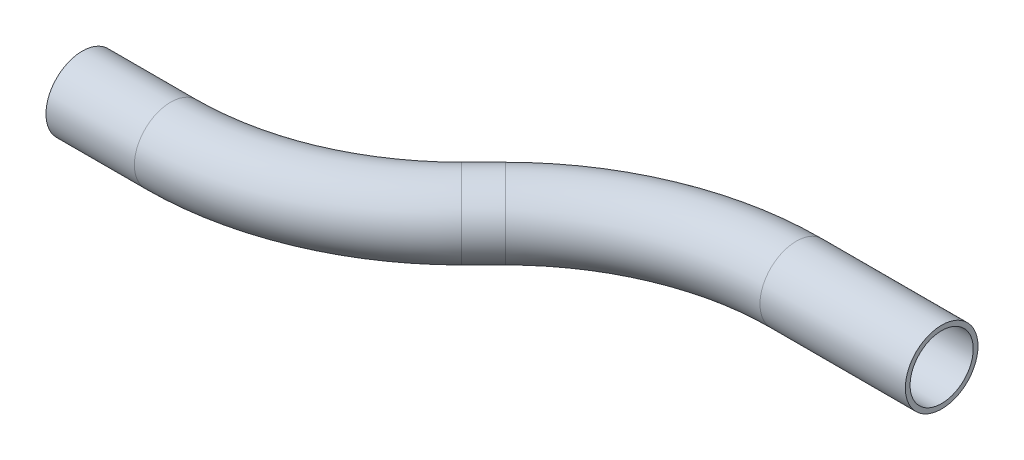
ISO-10303-21;
HEADER;
FILE_DESCRIPTION(('STEP AP214'),'2;1');
FILE_NAME('part.step','',(''),(''),'','','');
FILE_SCHEMA(('AUTOMOTIVE_DESIGN { 1 0 10303 214 1 1 1 1 }'));
ENDSEC;
DATA;
#1=APPLICATION_CONTEXT('core data for automotive mechanical design processes');
#2=APPLICATION_PROTOCOL_DEFINITION('international standard','automotive_design',2000,#1);
#3=PRODUCT_CONTEXT('',#1,'mechanical');
#4=PRODUCT('Part','Part','',(#3));
#5=PRODUCT_RELATED_PRODUCT_CATEGORY('part','',(#4));
#6=PRODUCT_DEFINITION_FORMATION('','',#4);
#7=PRODUCT_DEFINITION_CONTEXT('part definition',#1,'design');
#8=PRODUCT_DEFINITION('design','',#6,#7);
#9=PRODUCT_DEFINITION_SHAPE('','',#8);
#10=(LENGTH_UNIT() NAMED_UNIT(*) SI_UNIT(.MILLI.,.METRE.));
#11=(NAMED_UNIT(*) PLANE_ANGLE_UNIT() SI_UNIT($,.RADIAN.));
#12=(NAMED_UNIT(*) SI_UNIT($,.STERADIAN.) SOLID_ANGLE_UNIT());
#13=UNCERTAINTY_MEASURE_WITH_UNIT(LENGTH_MEASURE(1.E-05),#10,'distance_accuracy_value','');
#14=(GEOMETRIC_REPRESENTATION_CONTEXT(3) GLOBAL_UNCERTAINTY_ASSIGNED_CONTEXT((#13)) GLOBAL_UNIT_ASSIGNED_CONTEXT((#10,
#11,#12)) REPRESENTATION_CONTEXT('',''));
#15=CARTESIAN_POINT('',(0.,0.,0.));
#16=DIRECTION('',(0.,0.,1.));
#17=DIRECTION('',(1.,0.,0.));
#18=AXIS2_PLACEMENT_3D('',#15,#16,#17);
#19=CARTESIAN_POINT('',(0.,0.,0.));
#20=DIRECTION('',(1.,0.,0.));
#21=DIRECTION('',(0.,0.,-1.));
#22=AXIS2_PLACEMENT_3D('',#19,#20,#21);
#23=CYLINDRICAL_SURFACE('',#22,9.525);
#24=CARTESIAN_POINT('',(23.1755841511701,0.,0.));
#25=DIRECTION('',(1.,0.,0.));
#26=DIRECTION('',(0.,0.,-1.));
#27=AXIS2_PLACEMENT_3D('',#24,#25,#26);
#28=CIRCLE('',#27,9.525);
#29=CARTESIAN_POINT('',(23.1755841511701,0.,9.52499999999998));
#30=VERTEX_POINT('',#29);
#31=EDGE_CURVE('E57',#30,#30,#28,.T.);
#32=ORIENTED_EDGE('',*,*,#31,.F.);
#33=EDGE_LOOP('',(#32));
#34=FACE_BOUND('',#33,.T.);
#35=CARTESIAN_POINT('',(0.,0.,0.));
#36=DIRECTION('',(1.,0.,0.));
#37=DIRECTION('',(0.,0.,-1.));
#38=AXIS2_PLACEMENT_3D('',#35,#36,#37);
#39=CIRCLE('',#38,9.525);
#40=CARTESIAN_POINT('',(0.,0.,-9.525));
#41=VERTEX_POINT('',#40);
#42=EDGE_CURVE('E54',#41,#41,#39,.T.);
#43=ORIENTED_EDGE('',*,*,#42,.T.);
#44=EDGE_LOOP('',(#43));
#45=FACE_BOUND('',#44,.T.);
#46=ADVANCED_FACE('F33',(#34,#45),#23,.T.);
#47=CARTESIAN_POINT('',(23.1755841511701,0.,-76.2));
#48=DIRECTION('',(0.,1.,0.));
#49=DIRECTION('',(0.,0.,1.));
#50=AXIS2_PLACEMENT_3D('',#47,#48,#49);
#51=TOROIDAL_SURFACE('',#50,76.2,9.525);
#52=CARTESIAN_POINT('',(77.0571208775851,0.,-22.3184632735852));
#53=DIRECTION('',(0.707106781186546,0.,-0.707106781186549));
#54=DIRECTION('',(-0.707106781186549,0.,-0.707106781186546));
#55=AXIS2_PLACEMENT_3D('',#52,#53,#54);
#56=CIRCLE('',#55,9.525);
#57=CARTESIAN_POINT('',(83.792312968387,0.,-15.5832711827833));
#58=VERTEX_POINT('',#57);
#59=EDGE_CURVE('E60',#58,#58,#56,.T.);
#60=CARTESIAN_POINT('',(23.1755841511701,0.,-76.2));
#61=DIRECTION('',(0.,1.,0.));
#62=DIRECTION('',(0.,0.,1.));
#63=AXIS2_PLACEMENT_3D('',#60,#61,#62);
#64=CIRCLE('',#63,85.725);
#65=EDGE_CURVE('',#30,#58,#64,.T.);
#66=ORIENTED_EDGE('',*,*,#31,.T.);
#67=ORIENTED_EDGE('',*,*,#59,.F.);
#68=ORIENTED_EDGE('',*,*,#65,.T.);
#69=ORIENTED_EDGE('',*,*,#65,.F.);
#70=EDGE_LOOP('',(#66,#68,#67,#69));
#71=FACE_BOUND('',#70,.T.);
#72=ADVANCED_FACE('F79',(#71),#51,.T.);
#73=CARTESIAN_POINT('',(77.0571208775851,0.,-22.3184632735852));
#74=DIRECTION('',(0.70710678118655,0.,-0.707106781186545));
#75=DIRECTION('',(-0.707106781186545,0.,-0.70710678118655));
#76=AXIS2_PLACEMENT_3D('',#73,#74,#75);
#77=CYLINDRICAL_SURFACE('',#76,9.525);
#78=CARTESIAN_POINT('',(82.8363241304147,0.,-28.0976665264148));
#79=DIRECTION('',(0.70710678118655,0.,-0.707106781186546));
#80=DIRECTION('',(-0.707106781186546,0.,-0.70710678118655));
#81=AXIS2_PLACEMENT_3D('',#78,#79,#80);
#82=CIRCLE('',#81,9.525);
#83=CARTESIAN_POINT('',(76.1011320396128,0.,-34.8328586172167));
#84=VERTEX_POINT('',#83);
#85=EDGE_CURVE('E62',#84,#84,#82,.T.);
#86=ORIENTED_EDGE('',*,*,#85,.F.);
#87=EDGE_LOOP('',(#86));
#88=FACE_BOUND('',#87,.T.);
#89=ORIENTED_EDGE('',*,*,#59,.T.);
#90=EDGE_LOOP('',(#89));
#91=FACE_BOUND('',#90,.T.);
#92=ADVANCED_FACE('F72',(#88,#91),#77,.T.);
#93=CARTESIAN_POINT('',(136.71786085683,0.,25.7838702));
#94=DIRECTION('',(0.,-1.,0.));
#95=DIRECTION('',(0.,0.,-1.));
#96=AXIS2_PLACEMENT_3D('',#93,#94,#95);
#97=TOROIDAL_SURFACE('',#96,76.2,9.525);
#98=CARTESIAN_POINT('',(136.71786085683,0.,-50.4161298));
#99=DIRECTION('',(1.,0.,0.));
#100=DIRECTION('',(0.,0.,-1.));
#101=AXIS2_PLACEMENT_3D('',#98,#99,#100);
#102=CIRCLE('',#101,9.525);
#103=CARTESIAN_POINT('',(136.71786085683,0.,-59.9411298));
#104=VERTEX_POINT('',#103);
#105=EDGE_CURVE('E37',#104,#104,#102,.T.);
#106=CARTESIAN_POINT('',(136.71786085683,0.,25.7838702));
#107=DIRECTION('',(0.,-1.,0.));
#108=DIRECTION('',(0.,0.,-1.));
#109=AXIS2_PLACEMENT_3D('',#106,#107,#108);
#110=CIRCLE('',#109,85.725);
#111=EDGE_CURVE('',#84,#104,#110,.T.);
#112=ORIENTED_EDGE('',*,*,#85,.T.);
#113=ORIENTED_EDGE('',*,*,#105,.F.);
#114=ORIENTED_EDGE('',*,*,#111,.T.);
#115=ORIENTED_EDGE('',*,*,#111,.F.);
#116=EDGE_LOOP('',(#112,#114,#113,#115));
#117=FACE_BOUND('',#116,.T.);
#118=ADVANCED_FACE('F70',(#117),#97,.T.);
#119=CARTESIAN_POINT('',(136.71786085683,0.,-50.4161298));
#120=DIRECTION('',(1.,0.,0.));
#121=DIRECTION('',(0.,0.,-1.));
#122=AXIS2_PLACEMENT_3D('',#119,#120,#121);
#123=CYLINDRICAL_SURFACE('',#122,9.525);
#124=CARTESIAN_POINT('',(174.81786085683,0.,-50.4161298));
#125=DIRECTION('',(1.,0.,0.));
#126=DIRECTION('',(0.,0.,-1.));
#127=AXIS2_PLACEMENT_3D('',#124,#125,#126);
#128=CIRCLE('',#127,9.525);
#129=CARTESIAN_POINT('',(174.81786085683,0.,-59.9411298));
#130=VERTEX_POINT('',#129);
#131=EDGE_CURVE('E50',#130,#130,#128,.T.);
#132=ORIENTED_EDGE('',*,*,#131,.F.);
#133=EDGE_LOOP('',(#132));
#134=FACE_BOUND('',#133,.T.);
#135=ORIENTED_EDGE('',*,*,#105,.T.);
#136=EDGE_LOOP('',(#135));
#137=FACE_BOUND('',#136,.T.);
#138=ADVANCED_FACE('F35',(#134,#137),#123,.T.);
#139=CARTESIAN_POINT('',(0.,0.,0.));
#140=DIRECTION('',(1.,0.,0.));
#141=DIRECTION('',(0.,0.,-1.));
#142=AXIS2_PLACEMENT_3D('',#139,#140,#141);
#143=PLANE('',#142);
#144=CARTESIAN_POINT('',(0.,0.,0.));
#145=DIRECTION('',(1.,0.,0.));
#146=DIRECTION('',(0.,0.,-1.));
#147=AXIS2_PLACEMENT_3D('',#144,#145,#146);
#148=CIRCLE('',#147,8.2804);
#149=CARTESIAN_POINT('',(0.,0.,-8.2804));
#150=VERTEX_POINT('',#149);
#151=EDGE_CURVE('E53',#150,#150,#148,.F.);
#152=ORIENTED_EDGE('',*,*,#151,.F.);
#153=EDGE_LOOP('',(#152));
#154=FACE_BOUND('',#153,.T.);
#155=ORIENTED_EDGE('',*,*,#42,.F.);
#156=EDGE_LOOP('',(#155));
#157=FACE_BOUND('',#156,.T.);
#158=ADVANCED_FACE('F77',(#154,#157),#143,.F.);
#159=CARTESIAN_POINT('',(174.81786085683,0.,-50.4161298));
#160=DIRECTION('',(1.,0.,0.));
#161=DIRECTION('',(0.,0.,-1.));
#162=AXIS2_PLACEMENT_3D('',#159,#160,#161);
#163=PLANE('',#162);
#164=CARTESIAN_POINT('',(174.81786085683,0.,-50.4161298));
#165=DIRECTION('',(1.,0.,0.));
#166=DIRECTION('',(0.,0.,-1.));
#167=AXIS2_PLACEMENT_3D('',#164,#165,#166);
#168=CIRCLE('',#167,8.2804);
#169=CARTESIAN_POINT('',(174.81786085683,0.,-58.6965298));
#170=VERTEX_POINT('',#169);
#171=EDGE_CURVE('E10',#170,#170,#168,.F.);
#172=ORIENTED_EDGE('',*,*,#171,.T.);
#173=EDGE_LOOP('',(#172));
#174=FACE_BOUND('',#173,.T.);
#175=ORIENTED_EDGE('',*,*,#131,.T.);
#176=EDGE_LOOP('',(#175));
#177=FACE_BOUND('',#176,.T.);
#178=ADVANCED_FACE('F96',(#174,#177),#163,.T.);
#179=CARTESIAN_POINT('',(0.,0.,0.));
#180=DIRECTION('',(1.,0.,0.));
#181=DIRECTION('',(0.,0.,-1.));
#182=AXIS2_PLACEMENT_3D('',#179,#180,#181);
#183=CYLINDRICAL_SURFACE('',#182,8.2804);
#184=CARTESIAN_POINT('',(23.1755841511701,0.,0.));
#185=DIRECTION('',(1.,0.,0.));
#186=DIRECTION('',(0.,0.,-1.));
#187=AXIS2_PLACEMENT_3D('',#184,#185,#186);
#188=CIRCLE('',#187,8.2804);
#189=CARTESIAN_POINT('',(23.1755841511701,0.,8.28039999999996));
#190=VERTEX_POINT('',#189);
#191=EDGE_CURVE('E192',#190,#190,#188,.F.);
#192=ORIENTED_EDGE('',*,*,#191,.F.);
#193=EDGE_LOOP('',(#192));
#194=FACE_BOUND('',#193,.T.);
#195=ORIENTED_EDGE('',*,*,#151,.T.);
#196=EDGE_LOOP('',(#195));
#197=FACE_BOUND('',#196,.T.);
#198=ADVANCED_FACE('F99',(#194,#197),#183,.F.);
#199=CARTESIAN_POINT('',(23.1755841511701,0.,-76.2));
#200=DIRECTION('',(0.,1.,0.));
#201=DIRECTION('',(0.,0.,1.));
#202=AXIS2_PLACEMENT_3D('',#199,#200,#201);
#203=TOROIDAL_SURFACE('',#202,76.2,8.2804);
#204=CARTESIAN_POINT('',(77.0571208775851,0.,-22.3184632735852));
#205=DIRECTION('',(0.707106781186546,0.,-0.707106781186549));
#206=DIRECTION('',(-0.707106781186549,0.,-0.707106781186546));
#207=AXIS2_PLACEMENT_3D('',#204,#205,#206);
#208=CIRCLE('',#207,8.2804);
#209=CARTESIAN_POINT('',(82.9122478685222,0.,-16.4633362826481));
#210=VERTEX_POINT('',#209);
#211=EDGE_CURVE('E191',#210,#210,#208,.F.);
#212=CARTESIAN_POINT('',(23.1755841511701,0.,-76.2));
#213=DIRECTION('',(0.,1.,0.));
#214=DIRECTION('',(0.,0.,1.));
#215=AXIS2_PLACEMENT_3D('',#212,#213,#214);
#216=CIRCLE('',#215,84.4804);
#217=EDGE_CURVE('',#190,#210,#216,.T.);
#218=ORIENTED_EDGE('',*,*,#191,.T.);
#219=ORIENTED_EDGE('',*,*,#211,.F.);
#220=ORIENTED_EDGE('',*,*,#217,.T.);
#221=ORIENTED_EDGE('',*,*,#217,.F.);
#222=EDGE_LOOP('',(#218,#220,#219,#221));
#223=FACE_BOUND('',#222,.T.);
#224=ADVANCED_FACE('F154',(#223),#203,.F.);
#225=CARTESIAN_POINT('',(77.0571208775851,0.,-22.3184632735852));
#226=DIRECTION('',(0.70710678118655,0.,-0.707106781186545));
#227=DIRECTION('',(-0.707106781186545,0.,-0.70710678118655));
#228=AXIS2_PLACEMENT_3D('',#225,#226,#227);
#229=CYLINDRICAL_SURFACE('',#228,8.2804);
#230=CARTESIAN_POINT('',(82.8363241304147,0.,-28.0976665264148));
#231=DIRECTION('',(0.70710678118655,0.,-0.707106781186546));
#232=DIRECTION('',(-0.707106781186546,0.,-0.70710678118655));
#233=AXIS2_PLACEMENT_3D('',#230,#231,#232);
#234=CIRCLE('',#233,8.2804);
#235=CARTESIAN_POINT('',(76.9811971394776,0.,-33.9527935173519));
#236=VERTEX_POINT('',#235);
#237=EDGE_CURVE('E46',#236,#236,#234,.F.);
#238=ORIENTED_EDGE('',*,*,#237,.F.);
#239=EDGE_LOOP('',(#238));
#240=FACE_BOUND('',#239,.T.);
#241=ORIENTED_EDGE('',*,*,#211,.T.);
#242=EDGE_LOOP('',(#241));
#243=FACE_BOUND('',#242,.T.);
#244=ADVANCED_FACE('F90',(#240,#243),#229,.F.);
#245=CARTESIAN_POINT('',(136.71786085683,0.,25.7838702));
#246=DIRECTION('',(0.,-1.,0.));
#247=DIRECTION('',(0.,0.,-1.));
#248=AXIS2_PLACEMENT_3D('',#245,#246,#247);
#249=TOROIDAL_SURFACE('',#248,76.2,8.2804);
#250=CARTESIAN_POINT('',(136.71786085683,0.,-50.4161298));
#251=DIRECTION('',(1.,0.,0.));
#252=DIRECTION('',(0.,0.,-1.));
#253=AXIS2_PLACEMENT_3D('',#250,#251,#252);
#254=CIRCLE('',#253,8.2804);
#255=CARTESIAN_POINT('',(136.71786085683,0.,-58.6965298));
#256=VERTEX_POINT('',#255);
#257=EDGE_CURVE('E41',#256,#256,#254,.F.);
#258=CARTESIAN_POINT('',(136.71786085683,0.,25.7838702));
#259=DIRECTION('',(0.,-1.,0.));
#260=DIRECTION('',(0.,0.,-1.));
#261=AXIS2_PLACEMENT_3D('',#258,#259,#260);
#262=CIRCLE('',#261,84.4804);
#263=EDGE_CURVE('',#236,#256,#262,.T.);
#264=ORIENTED_EDGE('',*,*,#237,.T.);
#265=ORIENTED_EDGE('',*,*,#257,.F.);
#266=ORIENTED_EDGE('',*,*,#263,.T.);
#267=ORIENTED_EDGE('',*,*,#263,.F.);
#268=EDGE_LOOP('',(#264,#266,#265,#267));
#269=FACE_BOUND('',#268,.T.);
#270=ADVANCED_FACE('F84',(#269),#249,.F.);
#271=CARTESIAN_POINT('',(136.71786085683,0.,-50.4161298));
#272=DIRECTION('',(1.,0.,0.));
#273=DIRECTION('',(0.,0.,-1.));
#274=AXIS2_PLACEMENT_3D('',#271,#272,#273);
#275=CYLINDRICAL_SURFACE('',#274,8.2804);
#276=ORIENTED_EDGE('',*,*,#171,.F.);
#277=EDGE_LOOP('',(#276));
#278=FACE_BOUND('',#277,.T.);
#279=ORIENTED_EDGE('',*,*,#257,.T.);
#280=EDGE_LOOP('',(#279));
#281=FACE_BOUND('',#280,.T.);
#282=ADVANCED_FACE('F82',(#278,#281),#275,.F.);
#283=CLOSED_SHELL('',(#46,#72,#92,#118,#138,#158,#178,#198,#224,#244,#270,#282));
#284=MANIFOLD_SOLID_BREP('B2',#283);
#285=ADVANCED_BREP_SHAPE_REPRESENTATION('',(#18,#284),#14);
#286=SHAPE_DEFINITION_REPRESENTATION(#9,#285);
ENDSEC;
END-ISO-10303-21;
